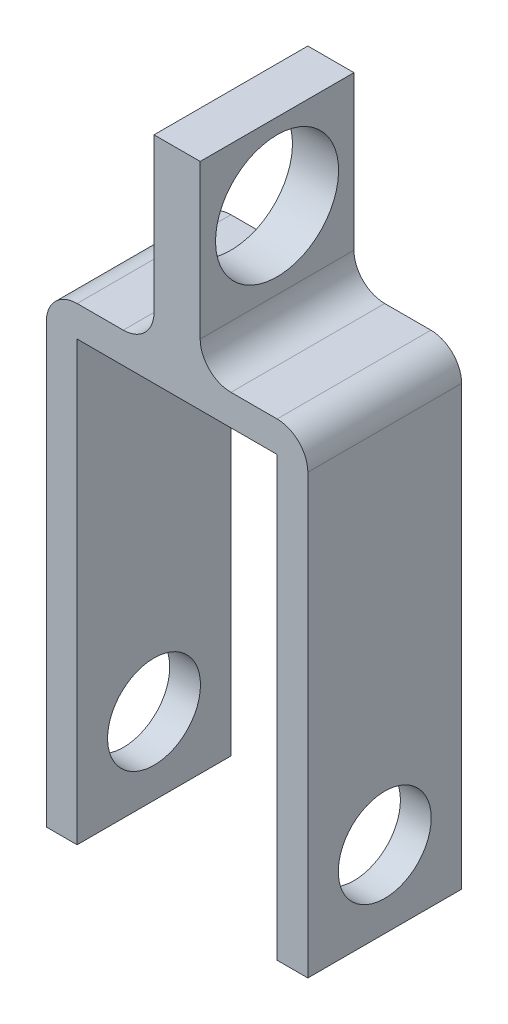
ISO-10303-21;
HEADER;
FILE_DESCRIPTION(('STEP AP214'),'2;1');
FILE_NAME('part.step','',(''),(''),'','','');
FILE_SCHEMA(('AUTOMOTIVE_DESIGN { 1 0 10303 214 1 1 1 1 }'));
ENDSEC;
DATA;
#1=APPLICATION_CONTEXT('core data for automotive mechanical design processes');
#2=APPLICATION_PROTOCOL_DEFINITION('international standard','automotive_design',2000,#1);
#3=PRODUCT_CONTEXT('',#1,'mechanical');
#4=PRODUCT('Part','Part','',(#3));
#5=PRODUCT_RELATED_PRODUCT_CATEGORY('part','',(#4));
#6=PRODUCT_DEFINITION_FORMATION('','',#4);
#7=PRODUCT_DEFINITION_CONTEXT('part definition',#1,'design');
#8=PRODUCT_DEFINITION('design','',#6,#7);
#9=PRODUCT_DEFINITION_SHAPE('','',#8);
#10=(LENGTH_UNIT() NAMED_UNIT(*) SI_UNIT(.MILLI.,.METRE.));
#11=(NAMED_UNIT(*) PLANE_ANGLE_UNIT() SI_UNIT($,.RADIAN.));
#12=(NAMED_UNIT(*) SI_UNIT($,.STERADIAN.) SOLID_ANGLE_UNIT());
#13=UNCERTAINTY_MEASURE_WITH_UNIT(LENGTH_MEASURE(1.E-05),#10,'distance_accuracy_value','');
#14=(GEOMETRIC_REPRESENTATION_CONTEXT(3) GLOBAL_UNCERTAINTY_ASSIGNED_CONTEXT((#13)) GLOBAL_UNIT_ASSIGNED_CONTEXT((#10,
#11,#12)) REPRESENTATION_CONTEXT('',''));
#15=CARTESIAN_POINT('',(0.,0.,0.));
#16=DIRECTION('',(0.,0.,1.));
#17=DIRECTION('',(1.,0.,0.));
#18=AXIS2_PLACEMENT_3D('',#15,#16,#17);
#19=CARTESIAN_POINT('',(-32.5,0.,50.));
#20=DIRECTION('',(1.,0.,0.));
#21=DIRECTION('',(0.,1.,0.));
#22=AXIS2_PLACEMENT_3D('',#19,#20,#21);
#23=PLANE('',#22);
#24=CARTESIAN_POINT('',(-32.5,-152.4,25.));
#25=DIRECTION('',(1.,0.,0.));
#26=DIRECTION('',(0.,1.,0.));
#27=AXIS2_PLACEMENT_3D('',#24,#25,#26);
#28=CIRCLE('',#27,15.1);
#29=CARTESIAN_POINT('',(-32.5,-137.3,25.));
#30=VERTEX_POINT('',#29);
#31=EDGE_CURVE('E450',#30,#30,#28,.T.);
#32=ORIENTED_EDGE('',*,*,#31,.F.);
#33=EDGE_LOOP('',(#32));
#34=FACE_BOUND('',#33,.T.);
#35=DIRECTION('',(0.,-1.,0.));
#36=VECTOR('',#35,1.);
#37=CARTESIAN_POINT('',(-32.5,0.,0.));
#38=LINE('',#37,#36);
#39=CARTESIAN_POINT('',(-32.5,-35.,0.));
#40=VERTEX_POINT('',#39);
#41=CARTESIAN_POINT('',(-32.5,-177.4,0.));
#42=VERTEX_POINT('',#41);
#43=EDGE_CURVE('E168',#40,#42,#38,.T.);
#44=ORIENTED_EDGE('',*,*,#43,.F.);
#45=DIRECTION('',(0.,0.,-1.));
#46=VECTOR('',#45,1.);
#47=CARTESIAN_POINT('',(-32.5,-35.,50.));
#48=LINE('',#47,#46);
#49=CARTESIAN_POINT('',(-32.5,-35.,50.));
#50=VERTEX_POINT('',#49);
#51=EDGE_CURVE('E163',#50,#40,#48,.T.);
#52=ORIENTED_EDGE('',*,*,#51,.F.);
#53=DIRECTION('',(0.,-1.,0.));
#54=VECTOR('',#53,1.);
#55=CARTESIAN_POINT('',(-32.5,0.,50.));
#56=LINE('',#55,#54);
#57=CARTESIAN_POINT('',(-32.5,-177.4,50.));
#58=VERTEX_POINT('',#57);
#59=EDGE_CURVE('E166',#50,#58,#56,.T.);
#60=ORIENTED_EDGE('',*,*,#59,.T.);
#61=DIRECTION('',(0.,0.,-1.));
#62=VECTOR('',#61,1.);
#63=CARTESIAN_POINT('',(-32.5,-177.4,50.));
#64=LINE('',#63,#62);
#65=EDGE_CURVE('E232',#58,#42,#64,.T.);
#66=ORIENTED_EDGE('',*,*,#65,.T.);
#67=EDGE_LOOP('',(#44,#52,#60,#66));
#68=FACE_BOUND('',#67,.T.);
#69=ADVANCED_FACE('F47',(#34,#68),#23,.T.);
#70=CARTESIAN_POINT('',(0.,-35.,50.));
#71=DIRECTION('',(0.,1.,0.));
#72=DIRECTION('',(0.,0.,1.));
#73=AXIS2_PLACEMENT_3D('',#70,#71,#72);
#74=PLANE('',#73);
#75=DIRECTION('',(1.,0.,0.));
#76=VECTOR('',#75,1.);
#77=CARTESIAN_POINT('',(0.,-35.,0.));
#78=LINE('',#77,#76);
#79=CARTESIAN_POINT('',(32.5,-35.,0.));
#80=VERTEX_POINT('',#79);
#81=EDGE_CURVE('E235',#40,#80,#78,.T.);
#82=ORIENTED_EDGE('',*,*,#81,.T.);
#83=DIRECTION('',(0.,0.,-1.));
#84=VECTOR('',#83,1.);
#85=CARTESIAN_POINT('',(32.5,-35.,50.));
#86=LINE('',#85,#84);
#87=CARTESIAN_POINT('',(32.5,-35.,50.));
#88=VERTEX_POINT('',#87);
#89=EDGE_CURVE('E173',#88,#80,#86,.T.);
#90=ORIENTED_EDGE('',*,*,#89,.F.);
#91=DIRECTION('',(1.,0.,0.));
#92=VECTOR('',#91,1.);
#93=CARTESIAN_POINT('',(0.,-35.,50.));
#94=LINE('',#93,#92);
#95=EDGE_CURVE('E176',#50,#88,#94,.T.);
#96=ORIENTED_EDGE('',*,*,#95,.F.);
#97=ORIENTED_EDGE('',*,*,#51,.T.);
#98=EDGE_LOOP('',(#82,#90,#96,#97));
#99=FACE_BOUND('',#98,.T.);
#100=ADVANCED_FACE('F177',(#99),#74,.F.);
#101=CARTESIAN_POINT('',(32.5,0.,50.));
#102=DIRECTION('',(1.,0.,0.));
#103=DIRECTION('',(0.,1.,0.));
#104=AXIS2_PLACEMENT_3D('',#101,#102,#103);
#105=PLANE('',#104);
#106=CARTESIAN_POINT('',(32.5,-152.4,25.));
#107=DIRECTION('',(1.,0.,0.));
#108=DIRECTION('',(0.,1.,0.));
#109=AXIS2_PLACEMENT_3D('',#106,#107,#108);
#110=CIRCLE('',#109,15.1);
#111=CARTESIAN_POINT('',(32.5,-137.3,25.));
#112=VERTEX_POINT('',#111);
#113=EDGE_CURVE('E447',#112,#112,#110,.T.);
#114=ORIENTED_EDGE('',*,*,#113,.T.);
#115=EDGE_LOOP('',(#114));
#116=FACE_BOUND('',#115,.T.);
#117=DIRECTION('',(0.,-1.,0.));
#118=VECTOR('',#117,1.);
#119=CARTESIAN_POINT('',(32.5,0.,0.));
#120=LINE('',#119,#118);
#121=CARTESIAN_POINT('',(32.5,-177.4,0.));
#122=VERTEX_POINT('',#121);
#123=EDGE_CURVE('E238',#80,#122,#120,.T.);
#124=ORIENTED_EDGE('',*,*,#123,.T.);
#125=DIRECTION('',(0.,0.,-1.));
#126=VECTOR('',#125,1.);
#127=CARTESIAN_POINT('',(32.5,-177.4,50.));
#128=LINE('',#127,#126);
#129=CARTESIAN_POINT('',(32.5,-177.4,50.));
#130=VERTEX_POINT('',#129);
#131=EDGE_CURVE('E287',#130,#122,#128,.T.);
#132=ORIENTED_EDGE('',*,*,#131,.F.);
#133=DIRECTION('',(0.,-1.,0.));
#134=VECTOR('',#133,1.);
#135=CARTESIAN_POINT('',(32.5,0.,50.));
#136=LINE('',#135,#134);
#137=EDGE_CURVE('E181',#88,#130,#136,.T.);
#138=ORIENTED_EDGE('',*,*,#137,.F.);
#139=ORIENTED_EDGE('',*,*,#89,.T.);
#140=EDGE_LOOP('',(#124,#132,#138,#139));
#141=FACE_BOUND('',#140,.T.);
#142=ADVANCED_FACE('F379',(#116,#141),#105,.F.);
#143=CARTESIAN_POINT('',(-4.92383911421257E-13,-177.4,50.));
#144=DIRECTION('',(0.,-1.,0.));
#145=DIRECTION('',(1.,0.,0.));
#146=AXIS2_PLACEMENT_3D('',#143,#144,#145);
#147=PLANE('',#146);
#148=DIRECTION('',(-1.,0.,0.));
#149=VECTOR('',#148,1.);
#150=CARTESIAN_POINT('',(-4.92383911421257E-13,-177.4,0.));
#151=LINE('',#150,#149);
#152=CARTESIAN_POINT('',(42.5,-177.4,0.));
#153=VERTEX_POINT('',#152);
#154=EDGE_CURVE('E242',#153,#122,#151,.T.);
#155=ORIENTED_EDGE('',*,*,#154,.F.);
#156=DIRECTION('',(0.,0.,-1.));
#157=VECTOR('',#156,1.);
#158=CARTESIAN_POINT('',(42.5,-177.4,50.));
#159=LINE('',#158,#157);
#160=CARTESIAN_POINT('',(42.5,-177.4,50.));
#161=VERTEX_POINT('',#160);
#162=EDGE_CURVE('E283',#161,#153,#159,.T.);
#163=ORIENTED_EDGE('',*,*,#162,.F.);
#164=DIRECTION('',(-1.,0.,0.));
#165=VECTOR('',#164,1.);
#166=CARTESIAN_POINT('',(-4.92383911421257E-13,-177.4,50.));
#167=LINE('',#166,#165);
#168=EDGE_CURVE('E200',#161,#130,#167,.T.);
#169=ORIENTED_EDGE('',*,*,#168,.T.);
#170=ORIENTED_EDGE('',*,*,#131,.T.);
#171=EDGE_LOOP('',(#155,#163,#169,#170));
#172=FACE_BOUND('',#171,.T.);
#173=ADVANCED_FACE('F386',(#172),#147,.T.);
#174=CARTESIAN_POINT('',(42.5,0.,50.));
#175=DIRECTION('',(1.,0.,0.));
#176=DIRECTION('',(0.,0.,-1.));
#177=AXIS2_PLACEMENT_3D('',#174,#175,#176);
#178=PLANE('',#177);
#179=CARTESIAN_POINT('',(42.5,-152.4,25.));
#180=DIRECTION('',(1.,0.,0.));
#181=DIRECTION('',(0.,0.,-1.));
#182=AXIS2_PLACEMENT_3D('',#179,#180,#181);
#183=CIRCLE('',#182,15.1);
#184=CARTESIAN_POINT('',(42.5,-152.4,9.9));
#185=VERTEX_POINT('',#184);
#186=EDGE_CURVE('E451',#185,#185,#183,.T.);
#187=ORIENTED_EDGE('',*,*,#186,.F.);
#188=EDGE_LOOP('',(#187));
#189=FACE_BOUND('',#188,.T.);
#190=DIRECTION('',(0.,-1.,0.));
#191=VECTOR('',#190,1.);
#192=CARTESIAN_POINT('',(42.5,0.,0.));
#193=LINE('',#192,#191);
#194=CARTESIAN_POINT('',(42.5,-35.,0.));
#195=VERTEX_POINT('',#194);
#196=EDGE_CURVE('E246',#195,#153,#193,.T.);
#197=ORIENTED_EDGE('',*,*,#196,.F.);
#198=DIRECTION('',(0.,0.,-1.));
#199=VECTOR('',#198,1.);
#200=CARTESIAN_POINT('',(42.5,-35.,50.));
#201=LINE('',#200,#199);
#202=CARTESIAN_POINT('',(42.5,-35.,50.));
#203=VERTEX_POINT('',#202);
#204=EDGE_CURVE('E72',#195,#203,#201,.F.);
#205=ORIENTED_EDGE('',*,*,#204,.T.);
#206=DIRECTION('',(0.,-1.,0.));
#207=VECTOR('',#206,1.);
#208=CARTESIAN_POINT('',(42.5,0.,50.));
#209=LINE('',#208,#207);
#210=EDGE_CURVE('E204',#203,#161,#209,.T.);
#211=ORIENTED_EDGE('',*,*,#210,.T.);
#212=ORIENTED_EDGE('',*,*,#162,.T.);
#213=EDGE_LOOP('',(#197,#205,#211,#212));
#214=FACE_BOUND('',#213,.T.);
#215=ADVANCED_FACE('F387',(#189,#214),#178,.T.);
#216=CARTESIAN_POINT('',(0.,-25.,50.));
#217=DIRECTION('',(0.,1.,0.));
#218=DIRECTION('',(0.,0.,1.));
#219=AXIS2_PLACEMENT_3D('',#216,#217,#218);
#220=PLANE('',#219);
#221=DIRECTION('',(1.,0.,0.));
#222=VECTOR('',#221,1.);
#223=CARTESIAN_POINT('',(0.,-25.,0.));
#224=LINE('',#223,#222);
#225=CARTESIAN_POINT('',(17.5,-25.,0.));
#226=VERTEX_POINT('',#225);
#227=CARTESIAN_POINT('',(32.5,-25.,0.));
#228=VERTEX_POINT('',#227);
#229=EDGE_CURVE('E249',#226,#228,#224,.T.);
#230=ORIENTED_EDGE('',*,*,#229,.F.);
#231=DIRECTION('',(0.,0.,-1.));
#232=VECTOR('',#231,1.);
#233=CARTESIAN_POINT('',(17.5,-25.,50.));
#234=LINE('',#233,#232);
#235=CARTESIAN_POINT('',(17.5,-25.,50.));
#236=VERTEX_POINT('',#235);
#237=EDGE_CURVE('E309',#226,#236,#234,.F.);
#238=ORIENTED_EDGE('',*,*,#237,.T.);
#239=DIRECTION('',(1.,0.,0.));
#240=VECTOR('',#239,1.);
#241=CARTESIAN_POINT('',(0.,-25.,50.));
#242=LINE('',#241,#240);
#243=CARTESIAN_POINT('',(32.5,-25.,50.));
#244=VERTEX_POINT('',#243);
#245=EDGE_CURVE('E207',#236,#244,#242,.T.);
#246=ORIENTED_EDGE('',*,*,#245,.T.);
#247=DIRECTION('',(0.,0.,-1.));
#248=VECTOR('',#247,1.);
#249=CARTESIAN_POINT('',(32.5,-25.,50.));
#250=LINE('',#249,#248);
#251=EDGE_CURVE('E305',#244,#228,#250,.T.);
#252=ORIENTED_EDGE('',*,*,#251,.T.);
#253=EDGE_LOOP('',(#230,#238,#246,#252));
#254=FACE_BOUND('',#253,.T.);
#255=ADVANCED_FACE('F344',(#254),#220,.T.);
#256=CARTESIAN_POINT('',(7.5,0.,50.));
#257=DIRECTION('',(1.,0.,0.));
#258=DIRECTION('',(0.,1.,0.));
#259=AXIS2_PLACEMENT_3D('',#256,#257,#258);
#260=PLANE('',#259);
#261=CARTESIAN_POINT('',(7.50000000000001,10.,25.));
#262=DIRECTION('',(1.,0.,0.));
#263=DIRECTION('',(0.,1.,0.));
#264=AXIS2_PLACEMENT_3D('',#261,#262,#263);
#265=CIRCLE('',#264,20.);
#266=CARTESIAN_POINT('',(7.5,30.,25.));
#267=VERTEX_POINT('',#266);
#268=EDGE_CURVE('E195',#267,#267,#265,.T.);
#269=ORIENTED_EDGE('',*,*,#268,.F.);
#270=EDGE_LOOP('',(#269));
#271=FACE_BOUND('',#270,.T.);
#272=DIRECTION('',(0.,-1.,0.));
#273=VECTOR('',#272,1.);
#274=CARTESIAN_POINT('',(7.5,0.,50.));
#275=LINE('',#274,#273);
#276=CARTESIAN_POINT('',(7.5,35.,50.));
#277=VERTEX_POINT('',#276);
#278=CARTESIAN_POINT('',(7.50000000000001,-15.,50.));
#279=VERTEX_POINT('',#278);
#280=EDGE_CURVE('E211',#277,#279,#275,.T.);
#281=ORIENTED_EDGE('',*,*,#280,.T.);
#282=DIRECTION('',(0.,0.,-1.));
#283=VECTOR('',#282,1.);
#284=CARTESIAN_POINT('',(7.50000000000001,-15.,0.));
#285=LINE('',#284,#283);
#286=CARTESIAN_POINT('',(7.50000000000001,-15.,0.));
#287=VERTEX_POINT('',#286);
#288=EDGE_CURVE('E301',#279,#287,#285,.T.);
#289=ORIENTED_EDGE('',*,*,#288,.T.);
#290=DIRECTION('',(0.,-1.,0.));
#291=VECTOR('',#290,1.);
#292=CARTESIAN_POINT('',(7.5,0.,0.));
#293=LINE('',#292,#291);
#294=CARTESIAN_POINT('',(7.5,35.,0.));
#295=VERTEX_POINT('',#294);
#296=EDGE_CURVE('E253',#295,#287,#293,.T.);
#297=ORIENTED_EDGE('',*,*,#296,.F.);
#298=DIRECTION('',(0.,0.,-1.));
#299=VECTOR('',#298,1.);
#300=CARTESIAN_POINT('',(7.5,35.,50.));
#301=LINE('',#300,#299);
#302=EDGE_CURVE('E280',#277,#295,#301,.T.);
#303=ORIENTED_EDGE('',*,*,#302,.F.);
#304=EDGE_LOOP('',(#281,#289,#297,#303));
#305=FACE_BOUND('',#304,.T.);
#306=ADVANCED_FACE('F352',(#271,#305),#260,.T.);
#307=CARTESIAN_POINT('',(0.,35.,50.));
#308=DIRECTION('',(0.,1.,0.));
#309=DIRECTION('',(-1.,0.,0.));
#310=AXIS2_PLACEMENT_3D('',#307,#308,#309);
#311=PLANE('',#310);
#312=DIRECTION('',(1.,0.,0.));
#313=VECTOR('',#312,1.);
#314=CARTESIAN_POINT('',(0.,35.,0.));
#315=LINE('',#314,#313);
#316=CARTESIAN_POINT('',(-7.5,35.,0.));
#317=VERTEX_POINT('',#316);
#318=EDGE_CURVE('E257',#317,#295,#315,.T.);
#319=ORIENTED_EDGE('',*,*,#318,.F.);
#320=DIRECTION('',(0.,0.,-1.));
#321=VECTOR('',#320,1.);
#322=CARTESIAN_POINT('',(-7.5,35.,50.));
#323=LINE('',#322,#321);
#324=CARTESIAN_POINT('',(-7.5,35.,50.));
#325=VERTEX_POINT('',#324);
#326=EDGE_CURVE('E277',#325,#317,#323,.T.);
#327=ORIENTED_EDGE('',*,*,#326,.F.);
#328=DIRECTION('',(1.,0.,0.));
#329=VECTOR('',#328,1.);
#330=CARTESIAN_POINT('',(0.,35.,50.));
#331=LINE('',#330,#329);
#332=EDGE_CURVE('E215',#325,#277,#331,.T.);
#333=ORIENTED_EDGE('',*,*,#332,.T.);
#334=ORIENTED_EDGE('',*,*,#302,.T.);
#335=EDGE_LOOP('',(#319,#327,#333,#334));
#336=FACE_BOUND('',#335,.T.);
#337=ADVANCED_FACE('F355',(#336),#311,.T.);
#338=CARTESIAN_POINT('',(-7.5,0.,50.));
#339=DIRECTION('',(1.,0.,0.));
#340=DIRECTION('',(0.,1.,0.));
#341=AXIS2_PLACEMENT_3D('',#338,#339,#340);
#342=PLANE('',#341);
#343=CARTESIAN_POINT('',(-7.50000000000001,9.99999999999999,25.));
#344=DIRECTION('',(1.,0.,0.));
#345=DIRECTION('',(0.,1.,0.));
#346=AXIS2_PLACEMENT_3D('',#343,#344,#345);
#347=CIRCLE('',#346,20.);
#348=CARTESIAN_POINT('',(-7.5,30.,25.));
#349=VERTEX_POINT('',#348);
#350=EDGE_CURVE('E51',#349,#349,#347,.T.);
#351=ORIENTED_EDGE('',*,*,#350,.T.);
#352=EDGE_LOOP('',(#351));
#353=FACE_BOUND('',#352,.T.);
#354=DIRECTION('',(0.,-1.,0.));
#355=VECTOR('',#354,1.);
#356=CARTESIAN_POINT('',(-7.5,0.,0.));
#357=LINE('',#356,#355);
#358=CARTESIAN_POINT('',(-7.50000000000001,-15.,0.));
#359=VERTEX_POINT('',#358);
#360=EDGE_CURVE('E261',#317,#359,#357,.T.);
#361=ORIENTED_EDGE('',*,*,#360,.T.);
#362=DIRECTION('',(0.,0.,-1.));
#363=VECTOR('',#362,1.);
#364=CARTESIAN_POINT('',(-7.50000000000001,-15.,50.));
#365=LINE('',#364,#363);
#366=CARTESIAN_POINT('',(-7.50000000000001,-15.,50.));
#367=VERTEX_POINT('',#366);
#368=EDGE_CURVE('E298',#359,#367,#365,.F.);
#369=ORIENTED_EDGE('',*,*,#368,.T.);
#370=DIRECTION('',(0.,-1.,0.));
#371=VECTOR('',#370,1.);
#372=CARTESIAN_POINT('',(-7.5,0.,50.));
#373=LINE('',#372,#371);
#374=EDGE_CURVE('E219',#325,#367,#373,.T.);
#375=ORIENTED_EDGE('',*,*,#374,.F.);
#376=ORIENTED_EDGE('',*,*,#326,.T.);
#377=EDGE_LOOP('',(#361,#369,#375,#376));
#378=FACE_BOUND('',#377,.T.);
#379=ADVANCED_FACE('F427',(#353,#378),#342,.F.);
#380=CARTESIAN_POINT('',(0.,-25.,50.));
#381=DIRECTION('',(0.,1.,0.));
#382=DIRECTION('',(0.,0.,1.));
#383=AXIS2_PLACEMENT_3D('',#380,#381,#382);
#384=PLANE('',#383);
#385=DIRECTION('',(1.,0.,0.));
#386=VECTOR('',#385,1.);
#387=CARTESIAN_POINT('',(0.,-25.,50.));
#388=LINE('',#387,#386);
#389=CARTESIAN_POINT('',(-32.5,-25.,50.));
#390=VERTEX_POINT('',#389);
#391=CARTESIAN_POINT('',(-17.5,-25.,50.));
#392=VERTEX_POINT('',#391);
#393=EDGE_CURVE('E223',#390,#392,#388,.T.);
#394=ORIENTED_EDGE('',*,*,#393,.T.);
#395=DIRECTION('',(0.,0.,-1.));
#396=VECTOR('',#395,1.);
#397=CARTESIAN_POINT('',(-17.5,-25.,50.));
#398=LINE('',#397,#396);
#399=CARTESIAN_POINT('',(-17.5,-25.,0.));
#400=VERTEX_POINT('',#399);
#401=EDGE_CURVE('E294',#392,#400,#398,.T.);
#402=ORIENTED_EDGE('',*,*,#401,.T.);
#403=DIRECTION('',(1.,0.,0.));
#404=VECTOR('',#403,1.);
#405=CARTESIAN_POINT('',(0.,-25.,0.));
#406=LINE('',#405,#404);
#407=CARTESIAN_POINT('',(-32.5,-25.,0.));
#408=VERTEX_POINT('',#407);
#409=EDGE_CURVE('E265',#408,#400,#406,.T.);
#410=ORIENTED_EDGE('',*,*,#409,.F.);
#411=DIRECTION('',(0.,0.,-1.));
#412=VECTOR('',#411,1.);
#413=CARTESIAN_POINT('',(-32.5,-25.,50.));
#414=LINE('',#413,#412);
#415=EDGE_CURVE('E172',#408,#390,#414,.F.);
#416=ORIENTED_EDGE('',*,*,#415,.T.);
#417=EDGE_LOOP('',(#394,#402,#410,#416));
#418=FACE_BOUND('',#417,.T.);
#419=ADVANCED_FACE('F365',(#418),#384,.T.);
#420=CARTESIAN_POINT('',(-42.5,0.,50.));
#421=DIRECTION('',(1.,0.,0.));
#422=DIRECTION('',(0.,1.,0.));
#423=AXIS2_PLACEMENT_3D('',#420,#421,#422);
#424=PLANE('',#423);
#425=CARTESIAN_POINT('',(-42.5,-152.4,25.));
#426=DIRECTION('',(1.,0.,0.));
#427=DIRECTION('',(0.,0.,-1.));
#428=AXIS2_PLACEMENT_3D('',#425,#426,#427);
#429=CIRCLE('',#428,15.1);
#430=CARTESIAN_POINT('',(-42.5,-152.4,9.9));
#431=VERTEX_POINT('',#430);
#432=EDGE_CURVE('E457',#431,#431,#429,.T.);
#433=ORIENTED_EDGE('',*,*,#432,.T.);
#434=EDGE_LOOP('',(#433));
#435=FACE_BOUND('',#434,.T.);
#436=DIRECTION('',(0.,-1.,0.));
#437=VECTOR('',#436,1.);
#438=CARTESIAN_POINT('',(-42.5,0.,50.));
#439=LINE('',#438,#437);
#440=CARTESIAN_POINT('',(-42.5,-35.,50.));
#441=VERTEX_POINT('',#440);
#442=CARTESIAN_POINT('',(-42.5,-177.4,50.));
#443=VERTEX_POINT('',#442);
#444=EDGE_CURVE('E227',#441,#443,#439,.T.);
#445=ORIENTED_EDGE('',*,*,#444,.F.);
#446=DIRECTION('',(0.,0.,-1.));
#447=VECTOR('',#446,1.);
#448=CARTESIAN_POINT('',(-42.5,-35.,0.));
#449=LINE('',#448,#447);
#450=CARTESIAN_POINT('',(-42.5,-35.,0.));
#451=VERTEX_POINT('',#450);
#452=EDGE_CURVE('E325',#441,#451,#449,.T.);
#453=ORIENTED_EDGE('',*,*,#452,.T.);
#454=DIRECTION('',(0.,-1.,0.));
#455=VECTOR('',#454,1.);
#456=CARTESIAN_POINT('',(-42.5,0.,0.));
#457=LINE('',#456,#455);
#458=CARTESIAN_POINT('',(-42.5,-177.4,0.));
#459=VERTEX_POINT('',#458);
#460=EDGE_CURVE('E192',#451,#459,#457,.T.);
#461=ORIENTED_EDGE('',*,*,#460,.T.);
#462=DIRECTION('',(0.,0.,-1.));
#463=VECTOR('',#462,1.);
#464=CARTESIAN_POINT('',(-42.5,-177.4,50.));
#465=LINE('',#464,#463);
#466=EDGE_CURVE('E273',#443,#459,#465,.T.);
#467=ORIENTED_EDGE('',*,*,#466,.F.);
#468=EDGE_LOOP('',(#445,#453,#461,#467));
#469=FACE_BOUND('',#468,.T.);
#470=ADVANCED_FACE('F373',(#435,#469),#424,.F.);
#471=CARTESIAN_POINT('',(4.92383911421257E-13,-177.4,50.));
#472=DIRECTION('',(0.,1.,0.));
#473=DIRECTION('',(-1.,0.,0.));
#474=AXIS2_PLACEMENT_3D('',#471,#472,#473);
#475=PLANE('',#474);
#476=DIRECTION('',(1.,0.,0.));
#477=VECTOR('',#476,1.);
#478=CARTESIAN_POINT('',(4.92383911421257E-13,-177.4,0.));
#479=LINE('',#478,#477);
#480=EDGE_CURVE('E188',#459,#42,#479,.T.);
#481=ORIENTED_EDGE('',*,*,#480,.T.);
#482=ORIENTED_EDGE('',*,*,#65,.F.);
#483=DIRECTION('',(1.,0.,0.));
#484=VECTOR('',#483,1.);
#485=CARTESIAN_POINT('',(4.92383911421257E-13,-177.4,50.));
#486=LINE('',#485,#484);
#487=EDGE_CURVE('E185',#443,#58,#486,.T.);
#488=ORIENTED_EDGE('',*,*,#487,.F.);
#489=ORIENTED_EDGE('',*,*,#466,.T.);
#490=EDGE_LOOP('',(#481,#482,#488,#489));
#491=FACE_BOUND('',#490,.T.);
#492=ADVANCED_FACE('F376',(#491),#475,.F.);
#493=CARTESIAN_POINT('',(0.,0.,50.));
#494=DIRECTION('',(0.,0.,1.));
#495=DIRECTION('',(1.,0.,0.));
#496=AXIS2_PLACEMENT_3D('',#493,#494,#495);
#497=PLANE('',#496);
#498=ORIENTED_EDGE('',*,*,#210,.F.);
#499=CARTESIAN_POINT('',(32.5,-35.,50.));
#500=DIRECTION('',(0.,0.,1.));
#501=DIRECTION('',(1.,0.,0.));
#502=AXIS2_PLACEMENT_3D('',#499,#500,#501);
#503=CIRCLE('',#502,10.);
#504=EDGE_CURVE('E322',#203,#244,#503,.T.);
#505=ORIENTED_EDGE('',*,*,#504,.T.);
#506=ORIENTED_EDGE('',*,*,#245,.F.);
#507=CARTESIAN_POINT('',(17.5,-15.,50.));
#508=DIRECTION('',(0.,0.,1.));
#509=DIRECTION('',(1.,0.,0.));
#510=AXIS2_PLACEMENT_3D('',#507,#508,#509);
#511=CIRCLE('',#510,10.);
#512=EDGE_CURVE('E11',#236,#279,#511,.F.);
#513=ORIENTED_EDGE('',*,*,#512,.T.);
#514=ORIENTED_EDGE('',*,*,#280,.F.);
#515=ORIENTED_EDGE('',*,*,#332,.F.);
#516=ORIENTED_EDGE('',*,*,#374,.T.);
#517=CARTESIAN_POINT('',(-17.5,-15.,50.));
#518=DIRECTION('',(0.,0.,1.));
#519=DIRECTION('',(1.,0.,0.));
#520=AXIS2_PLACEMENT_3D('',#517,#518,#519);
#521=CIRCLE('',#520,10.);
#522=EDGE_CURVE('E332',#367,#392,#521,.F.);
#523=ORIENTED_EDGE('',*,*,#522,.T.);
#524=ORIENTED_EDGE('',*,*,#393,.F.);
#525=CARTESIAN_POINT('',(-32.5,-35.,50.));
#526=DIRECTION('',(0.,0.,1.));
#527=DIRECTION('',(1.,0.,0.));
#528=AXIS2_PLACEMENT_3D('',#525,#526,#527);
#529=CIRCLE('',#528,10.);
#530=EDGE_CURVE('E64',#390,#441,#529,.T.);
#531=ORIENTED_EDGE('',*,*,#530,.T.);
#532=ORIENTED_EDGE('',*,*,#444,.T.);
#533=ORIENTED_EDGE('',*,*,#487,.T.);
#534=ORIENTED_EDGE('',*,*,#59,.F.);
#535=ORIENTED_EDGE('',*,*,#95,.T.);
#536=ORIENTED_EDGE('',*,*,#137,.T.);
#537=ORIENTED_EDGE('',*,*,#168,.F.);
#538=EDGE_LOOP('',(#498,#505,#506,#513,#514,#515,#516,#523,#524,#531,#532,#533,#534,#535,#536,#537));
#539=FACE_BOUND('',#538,.T.);
#540=ADVANCED_FACE('F183',(#539),#497,.T.);
#541=CARTESIAN_POINT('',(0.,0.,0.));
#542=DIRECTION('',(0.,0.,1.));
#543=DIRECTION('',(1.,0.,0.));
#544=AXIS2_PLACEMENT_3D('',#541,#542,#543);
#545=PLANE('',#544);
#546=ORIENTED_EDGE('',*,*,#229,.T.);
#547=CARTESIAN_POINT('',(32.5,-35.,0.));
#548=DIRECTION('',(0.,0.,1.));
#549=DIRECTION('',(1.,0.,0.));
#550=AXIS2_PLACEMENT_3D('',#547,#548,#549);
#551=CIRCLE('',#550,10.);
#552=EDGE_CURVE('E315',#228,#195,#551,.F.);
#553=ORIENTED_EDGE('',*,*,#552,.T.);
#554=ORIENTED_EDGE('',*,*,#196,.T.);
#555=ORIENTED_EDGE('',*,*,#154,.T.);
#556=ORIENTED_EDGE('',*,*,#123,.F.);
#557=ORIENTED_EDGE('',*,*,#81,.F.);
#558=ORIENTED_EDGE('',*,*,#43,.T.);
#559=ORIENTED_EDGE('',*,*,#480,.F.);
#560=ORIENTED_EDGE('',*,*,#460,.F.);
#561=CARTESIAN_POINT('',(-32.5,-35.,0.));
#562=DIRECTION('',(0.,0.,1.));
#563=DIRECTION('',(1.,0.,0.));
#564=AXIS2_PLACEMENT_3D('',#561,#562,#563);
#565=CIRCLE('',#564,10.);
#566=EDGE_CURVE('E312',#451,#408,#565,.F.);
#567=ORIENTED_EDGE('',*,*,#566,.T.);
#568=ORIENTED_EDGE('',*,*,#409,.T.);
#569=CARTESIAN_POINT('',(-17.5,-15.,0.));
#570=DIRECTION('',(0.,0.,1.));
#571=DIRECTION('',(1.,0.,0.));
#572=AXIS2_PLACEMENT_3D('',#569,#570,#571);
#573=CIRCLE('',#572,10.);
#574=EDGE_CURVE('E329',#400,#359,#573,.T.);
#575=ORIENTED_EDGE('',*,*,#574,.T.);
#576=ORIENTED_EDGE('',*,*,#360,.F.);
#577=ORIENTED_EDGE('',*,*,#318,.T.);
#578=ORIENTED_EDGE('',*,*,#296,.T.);
#579=CARTESIAN_POINT('',(17.5,-15.,0.));
#580=DIRECTION('',(0.,0.,1.));
#581=DIRECTION('',(1.,0.,0.));
#582=AXIS2_PLACEMENT_3D('',#579,#580,#581);
#583=CIRCLE('',#582,10.);
#584=EDGE_CURVE('E57',#287,#226,#583,.T.);
#585=ORIENTED_EDGE('',*,*,#584,.T.);
#586=EDGE_LOOP('',(#546,#553,#554,#555,#556,#557,#558,#559,#560,#567,#568,#575,#576,#577,#578,#585));
#587=FACE_BOUND('',#586,.T.);
#588=ADVANCED_FACE('F338',(#587),#545,.F.);
#589=CARTESIAN_POINT('',(-17.5,-15.,50.));
#590=DIRECTION('',(0.,0.,-1.));
#591=DIRECTION('',(-1.,0.,0.));
#592=AXIS2_PLACEMENT_3D('',#589,#590,#591);
#593=CYLINDRICAL_SURFACE('',#592,10.);
#594=ORIENTED_EDGE('',*,*,#522,.F.);
#595=ORIENTED_EDGE('',*,*,#368,.F.);
#596=ORIENTED_EDGE('',*,*,#574,.F.);
#597=ORIENTED_EDGE('',*,*,#401,.F.);
#598=EDGE_LOOP('',(#594,#595,#596,#597));
#599=FACE_BOUND('',#598,.T.);
#600=ADVANCED_FACE('F362',(#599),#593,.F.);
#601=CARTESIAN_POINT('',(17.5,-15.,50.));
#602=DIRECTION('',(0.,0.,1.));
#603=DIRECTION('',(1.,0.,0.));
#604=AXIS2_PLACEMENT_3D('',#601,#602,#603);
#605=CYLINDRICAL_SURFACE('',#604,10.);
#606=ORIENTED_EDGE('',*,*,#512,.F.);
#607=ORIENTED_EDGE('',*,*,#237,.F.);
#608=ORIENTED_EDGE('',*,*,#584,.F.);
#609=ORIENTED_EDGE('',*,*,#288,.F.);
#610=EDGE_LOOP('',(#606,#607,#608,#609));
#611=FACE_BOUND('',#610,.T.);
#612=ADVANCED_FACE('F348',(#611),#605,.F.);
#613=CARTESIAN_POINT('',(32.5,-35.,50.));
#614=DIRECTION('',(0.,0.,-1.));
#615=DIRECTION('',(-1.,0.,0.));
#616=AXIS2_PLACEMENT_3D('',#613,#614,#615);
#617=CYLINDRICAL_SURFACE('',#616,10.);
#618=ORIENTED_EDGE('',*,*,#504,.F.);
#619=ORIENTED_EDGE('',*,*,#204,.F.);
#620=ORIENTED_EDGE('',*,*,#552,.F.);
#621=ORIENTED_EDGE('',*,*,#251,.F.);
#622=EDGE_LOOP('',(#618,#619,#620,#621));
#623=FACE_BOUND('',#622,.T.);
#624=ADVANCED_FACE('F389',(#623),#617,.T.);
#625=CARTESIAN_POINT('',(-32.5,-35.,50.));
#626=DIRECTION('',(0.,0.,1.));
#627=DIRECTION('',(1.,0.,0.));
#628=AXIS2_PLACEMENT_3D('',#625,#626,#627);
#629=CYLINDRICAL_SURFACE('',#628,10.);
#630=ORIENTED_EDGE('',*,*,#530,.F.);
#631=ORIENTED_EDGE('',*,*,#415,.F.);
#632=ORIENTED_EDGE('',*,*,#566,.F.);
#633=ORIENTED_EDGE('',*,*,#452,.F.);
#634=EDGE_LOOP('',(#630,#631,#632,#633));
#635=FACE_BOUND('',#634,.T.);
#636=ADVANCED_FACE('F49',(#635),#629,.T.);
#637=CARTESIAN_POINT('',(-42.5,9.99999999999999,25.));
#638=DIRECTION('',(1.,0.,0.));
#639=DIRECTION('',(0.,1.,0.));
#640=AXIS2_PLACEMENT_3D('',#637,#638,#639);
#641=CYLINDRICAL_SURFACE('',#640,20.);
#642=ORIENTED_EDGE('',*,*,#268,.T.);
#643=EDGE_LOOP('',(#642));
#644=FACE_BOUND('',#643,.T.);
#645=ORIENTED_EDGE('',*,*,#350,.F.);
#646=EDGE_LOOP('',(#645));
#647=FACE_BOUND('',#646,.T.);
#648=ADVANCED_FACE('F395',(#644,#647),#641,.F.);
#649=CARTESIAN_POINT('',(-42.5,-152.4,25.));
#650=DIRECTION('',(1.,0.,0.));
#651=DIRECTION('',(0.,0.,-1.));
#652=AXIS2_PLACEMENT_3D('',#649,#650,#651);
#653=CYLINDRICAL_SURFACE('',#652,15.1);
#654=ORIENTED_EDGE('',*,*,#31,.T.);
#655=EDGE_LOOP('',(#654));
#656=FACE_BOUND('',#655,.T.);
#657=ORIENTED_EDGE('',*,*,#432,.F.);
#658=EDGE_LOOP('',(#657));
#659=FACE_BOUND('',#658,.T.);
#660=ADVANCED_FACE('F464',(#656,#659),#653,.F.);
#661=ORIENTED_EDGE('',*,*,#186,.T.);
#662=EDGE_LOOP('',(#661));
#663=FACE_BOUND('',#662,.T.);
#664=ORIENTED_EDGE('',*,*,#113,.F.);
#665=EDGE_LOOP('',(#664));
#666=FACE_BOUND('',#665,.T.);
#667=ADVANCED_FACE('F466',(#663,#666),#653,.F.);
#668=CLOSED_SHELL('',(#69,#100,#142,#173,#215,#255,#306,#337,#379,#419,#470,#492,#540,#588,#600,
#612,#624,#636,#648,#660,#667));
#669=MANIFOLD_SOLID_BREP('B2',#668);
#670=ADVANCED_BREP_SHAPE_REPRESENTATION('',(#18,#669),#14);
#671=SHAPE_DEFINITION_REPRESENTATION(#9,#670);
ENDSEC;
END-ISO-10303-21;
